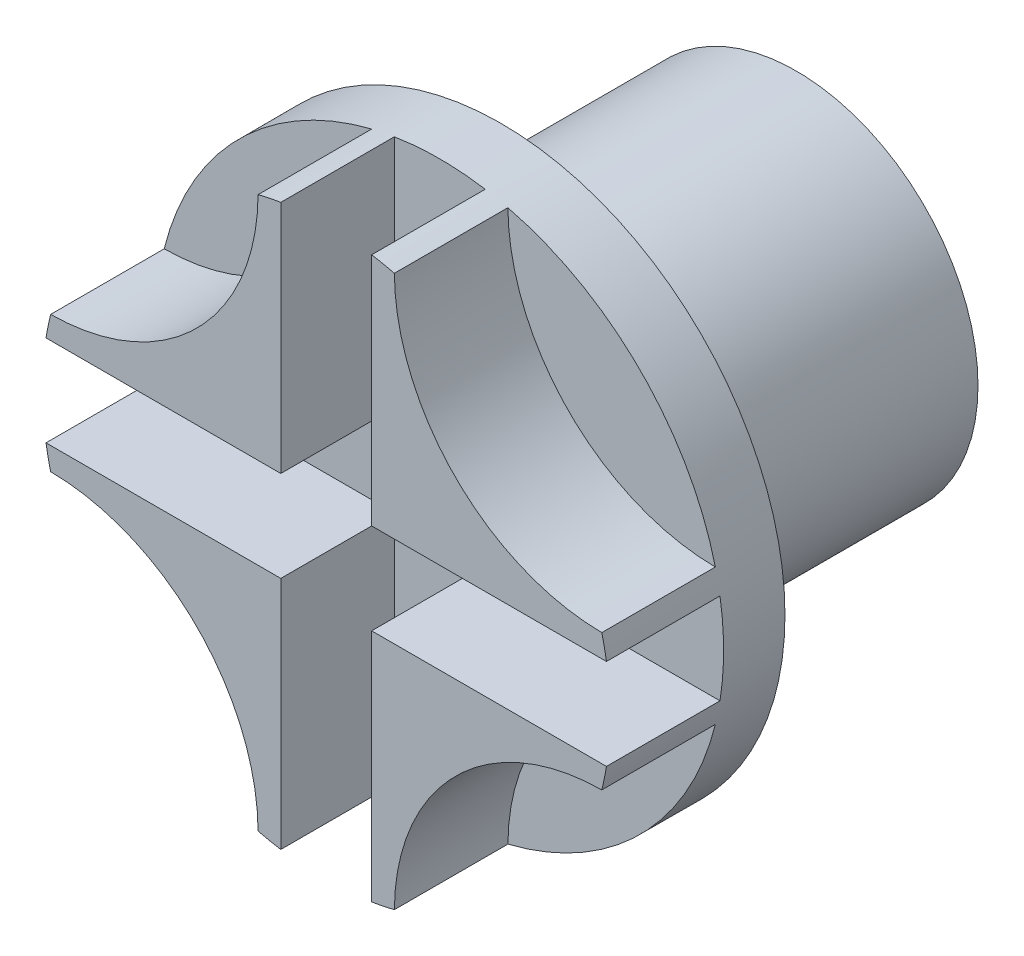
ISO-10303-21;
HEADER;
FILE_DESCRIPTION(('STEP AP214'),'2;1');
FILE_NAME('part.step','',(''),(''),'','','');
FILE_SCHEMA(('AUTOMOTIVE_DESIGN { 1 0 10303 214 1 1 1 1 }'));
ENDSEC;
DATA;
#1=APPLICATION_CONTEXT('core data for automotive mechanical design processes');
#2=APPLICATION_PROTOCOL_DEFINITION('international standard','automotive_design',2000,#1);
#3=PRODUCT_CONTEXT('',#1,'mechanical');
#4=PRODUCT('Part','Part','',(#3));
#5=PRODUCT_RELATED_PRODUCT_CATEGORY('part','',(#4));
#6=PRODUCT_DEFINITION_FORMATION('','',#4);
#7=PRODUCT_DEFINITION_CONTEXT('part definition',#1,'design');
#8=PRODUCT_DEFINITION('design','',#6,#7);
#9=PRODUCT_DEFINITION_SHAPE('','',#8);
#10=(LENGTH_UNIT() NAMED_UNIT(*) SI_UNIT(.MILLI.,.METRE.));
#11=(NAMED_UNIT(*) PLANE_ANGLE_UNIT() SI_UNIT($,.RADIAN.));
#12=(NAMED_UNIT(*) SI_UNIT($,.STERADIAN.) SOLID_ANGLE_UNIT());
#13=UNCERTAINTY_MEASURE_WITH_UNIT(LENGTH_MEASURE(1.E-05),#10,'distance_accuracy_value','');
#14=(GEOMETRIC_REPRESENTATION_CONTEXT(3) GLOBAL_UNCERTAINTY_ASSIGNED_CONTEXT((#13)) GLOBAL_UNIT_ASSIGNED_CONTEXT((#10,
#11,#12)) REPRESENTATION_CONTEXT('',''));
#15=CARTESIAN_POINT('',(0.,0.,0.));
#16=DIRECTION('',(0.,0.,1.));
#17=DIRECTION('',(1.,0.,0.));
#18=AXIS2_PLACEMENT_3D('',#15,#16,#17);
#19=CARTESIAN_POINT('',(0.,0.,2.7));
#20=DIRECTION('',(0.,0.,1.));
#21=DIRECTION('',(1.,0.,0.));
#22=AXIS2_PLACEMENT_3D('',#19,#20,#21);
#23=PLANE('',#22);
#24=DIRECTION('',(-1.,0.,0.));
#25=VECTOR('',#24,1.);
#26=CARTESIAN_POINT('',(0.,-2.,2.7));
#27=LINE('',#26,#25);
#28=CARTESIAN_POINT('',(-2.,-2.,2.7));
#29=VERTEX_POINT('',#28);
#30=CARTESIAN_POINT('',(-12.3389626792531,-2.,2.7));
#31=VERTEX_POINT('',#30);
#32=EDGE_CURVE('E50',#29,#31,#27,.T.);
#33=ORIENTED_EDGE('',*,*,#32,.F.);
#34=DIRECTION('',(0.,1.,0.));
#35=VECTOR('',#34,1.);
#36=CARTESIAN_POINT('',(-2.,0.,2.7));
#37=LINE('',#36,#35);
#38=CARTESIAN_POINT('',(-2.,-12.3389626792531,2.7));
#39=VERTEX_POINT('',#38);
#40=EDGE_CURVE('E206',#39,#29,#37,.T.);
#41=ORIENTED_EDGE('',*,*,#40,.F.);
#42=CARTESIAN_POINT('',(0.,0.,2.7));
#43=DIRECTION('',(0.,0.,1.));
#44=DIRECTION('',(1.,0.,0.));
#45=AXIS2_PLACEMENT_3D('',#42,#43,#44);
#46=CIRCLE('',#45,12.5);
#47=CARTESIAN_POINT('',(2.,-12.3389626792531,2.7));
#48=VERTEX_POINT('',#47);
#49=EDGE_CURVE('E317',#39,#48,#46,.T.);
#50=ORIENTED_EDGE('',*,*,#49,.T.);
#51=DIRECTION('',(0.,1.,0.));
#52=VECTOR('',#51,1.);
#53=CARTESIAN_POINT('',(2.,0.,2.7));
#54=LINE('',#53,#52);
#55=CARTESIAN_POINT('',(2.,-2.,2.7));
#56=VERTEX_POINT('',#55);
#57=EDGE_CURVE('E221',#48,#56,#54,.T.);
#58=ORIENTED_EDGE('',*,*,#57,.T.);
#59=DIRECTION('',(-1.,0.,0.));
#60=VECTOR('',#59,1.);
#61=CARTESIAN_POINT('',(0.,-2.,2.7));
#62=LINE('',#61,#60);
#63=CARTESIAN_POINT('',(12.3389626792531,-2.,2.7));
#64=VERTEX_POINT('',#63);
#65=EDGE_CURVE('E233',#64,#56,#62,.T.);
#66=ORIENTED_EDGE('',*,*,#65,.F.);
#67=CARTESIAN_POINT('',(12.3389626792531,2.,2.7));
#68=VERTEX_POINT('',#67);
#69=EDGE_CURVE('E326',#64,#68,#46,.T.);
#70=ORIENTED_EDGE('',*,*,#69,.T.);
#71=DIRECTION('',(1.,0.,0.));
#72=VECTOR('',#71,1.);
#73=CARTESIAN_POINT('',(0.,2.,2.7));
#74=LINE('',#73,#72);
#75=CARTESIAN_POINT('',(2.,2.,2.7));
#76=VERTEX_POINT('',#75);
#77=EDGE_CURVE('E255',#76,#68,#74,.T.);
#78=ORIENTED_EDGE('',*,*,#77,.F.);
#79=DIRECTION('',(0.,1.,0.));
#80=VECTOR('',#79,1.);
#81=CARTESIAN_POINT('',(2.,0.,2.7));
#82=LINE('',#81,#80);
#83=CARTESIAN_POINT('',(2.,12.3389626792531,2.7));
#84=VERTEX_POINT('',#83);
#85=EDGE_CURVE('E268',#76,#84,#82,.T.);
#86=ORIENTED_EDGE('',*,*,#85,.T.);
#87=CARTESIAN_POINT('',(-2.,12.3389626792531,2.7));
#88=VERTEX_POINT('',#87);
#89=EDGE_CURVE('E319',#84,#88,#46,.T.);
#90=ORIENTED_EDGE('',*,*,#89,.T.);
#91=DIRECTION('',(0.,1.,0.));
#92=VECTOR('',#91,1.);
#93=CARTESIAN_POINT('',(-2.,0.,2.7));
#94=LINE('',#93,#92);
#95=CARTESIAN_POINT('',(-2.,2.,2.7));
#96=VERTEX_POINT('',#95);
#97=EDGE_CURVE('E288',#96,#88,#94,.T.);
#98=ORIENTED_EDGE('',*,*,#97,.F.);
#99=DIRECTION('',(1.,0.,0.));
#100=VECTOR('',#99,1.);
#101=CARTESIAN_POINT('',(0.,2.,2.7));
#102=LINE('',#101,#100);
#103=CARTESIAN_POINT('',(-12.3389626792531,2.,2.7));
#104=VERTEX_POINT('',#103);
#105=EDGE_CURVE('E300',#104,#96,#102,.T.);
#106=ORIENTED_EDGE('',*,*,#105,.F.);
#107=EDGE_CURVE('E316',#104,#31,#46,.T.);
#108=ORIENTED_EDGE('',*,*,#107,.T.);
#109=EDGE_LOOP('',(#33,#41,#50,#58,#66,#70,#78,#86,#90,#98,#106,#108));
#110=FACE_BOUND('',#109,.T.);
#111=ADVANCED_FACE('F35',(#110),#23,.T.);
#112=CARTESIAN_POINT('',(-12.1997696102581,-12.1997696102581,2.7));
#113=DIRECTION('',(0.,0.,1.));
#114=DIRECTION('',(1.,0.,0.));
#115=AXIS2_PLACEMENT_3D('',#112,#113,#114);
#116=CIRCLE('',#115,9.2);
#117=CARTESIAN_POINT('',(-3.,-12.1346610995116,2.7));
#118=VERTEX_POINT('',#117);
#119=CARTESIAN_POINT('',(-12.1346610995116,-3.,2.7));
#120=VERTEX_POINT('',#119);
#121=EDGE_CURVE('E204',#118,#120,#116,.T.);
#122=ORIENTED_EDGE('',*,*,#121,.T.);
#123=EDGE_CURVE('E57',#120,#118,#46,.T.);
#124=ORIENTED_EDGE('',*,*,#123,.T.);
#125=EDGE_LOOP('',(#122,#124));
#126=FACE_BOUND('',#125,.T.);
#127=ADVANCED_FACE('F397',(#126),#23,.T.);
#128=CARTESIAN_POINT('',(12.1997696102581,12.1997696102581,2.7));
#129=DIRECTION('',(0.,0.,1.));
#130=DIRECTION('',(1.,0.,0.));
#131=AXIS2_PLACEMENT_3D('',#128,#129,#130);
#132=CIRCLE('',#131,9.2);
#133=CARTESIAN_POINT('',(3.,12.1346610995116,2.7));
#134=VERTEX_POINT('',#133);
#135=CARTESIAN_POINT('',(12.1346610995116,3.,2.7));
#136=VERTEX_POINT('',#135);
#137=EDGE_CURVE('E251',#134,#136,#132,.T.);
#138=ORIENTED_EDGE('',*,*,#137,.T.);
#139=EDGE_CURVE('E321',#136,#134,#46,.T.);
#140=ORIENTED_EDGE('',*,*,#139,.T.);
#141=EDGE_LOOP('',(#138,#140));
#142=FACE_BOUND('',#141,.T.);
#143=ADVANCED_FACE('F399',(#142),#23,.T.);
#144=CARTESIAN_POINT('',(-3.,12.1346610995116,2.7));
#145=VERTEX_POINT('',#144);
#146=CARTESIAN_POINT('',(-12.1346610995116,3.,2.7));
#147=VERTEX_POINT('',#146);
#148=EDGE_CURVE('E43',#145,#147,#46,.T.);
#149=ORIENTED_EDGE('',*,*,#148,.T.);
#150=CARTESIAN_POINT('',(-12.1997696102581,12.1997696102581,2.7));
#151=DIRECTION('',(0.,0.,1.));
#152=DIRECTION('',(1.,0.,0.));
#153=AXIS2_PLACEMENT_3D('',#150,#151,#152);
#154=CIRCLE('',#153,9.2);
#155=EDGE_CURVE('E284',#147,#145,#154,.T.);
#156=ORIENTED_EDGE('',*,*,#155,.T.);
#157=EDGE_LOOP('',(#149,#156));
#158=FACE_BOUND('',#157,.T.);
#159=ADVANCED_FACE('F388',(#158),#23,.T.);
#160=CARTESIAN_POINT('',(0.,0.,2.7));
#161=DIRECTION('',(0.,0.,-1.));
#162=DIRECTION('',(-1.,0.,0.));
#163=AXIS2_PLACEMENT_3D('',#160,#161,#162);
#164=CYLINDRICAL_SURFACE('',#163,12.5);
#165=ORIENTED_EDGE('',*,*,#148,.F.);
#166=DIRECTION('',(0.,0.,-1.));
#167=VECTOR('',#166,1.);
#168=CARTESIAN_POINT('',(-3.,12.1346610995116,7.7));
#169=LINE('',#168,#167);
#170=CARTESIAN_POINT('',(-3.,12.1346610995116,7.7));
#171=VERTEX_POINT('',#170);
#172=EDGE_CURVE('E313',#171,#145,#169,.T.);
#173=ORIENTED_EDGE('',*,*,#172,.F.);
#174=CARTESIAN_POINT('',(0.,0.,7.7));
#175=DIRECTION('',(0.,0.,1.));
#176=DIRECTION('',(1.,0.,0.));
#177=AXIS2_PLACEMENT_3D('',#174,#175,#176);
#178=CIRCLE('',#177,12.5);
#179=CARTESIAN_POINT('',(-2.,12.3389626792531,7.7));
#180=VERTEX_POINT('',#179);
#181=EDGE_CURVE('E285',#180,#171,#178,.T.);
#182=ORIENTED_EDGE('',*,*,#181,.F.);
#183=DIRECTION('',(0.,0.,-1.));
#184=VECTOR('',#183,1.);
#185=CARTESIAN_POINT('',(-2.,12.3389626792531,7.7));
#186=LINE('',#185,#184);
#187=EDGE_CURVE('E297',#180,#88,#186,.T.);
#188=ORIENTED_EDGE('',*,*,#187,.T.);
#189=ORIENTED_EDGE('',*,*,#89,.F.);
#190=DIRECTION('',(0.,0.,-1.));
#191=VECTOR('',#190,1.);
#192=CARTESIAN_POINT('',(2.,12.3389626792531,7.7));
#193=LINE('',#192,#191);
#194=CARTESIAN_POINT('',(2.,12.3389626792531,7.7));
#195=VERTEX_POINT('',#194);
#196=EDGE_CURVE('E278',#195,#84,#193,.T.);
#197=ORIENTED_EDGE('',*,*,#196,.F.);
#198=CARTESIAN_POINT('',(0.,0.,7.7));
#199=DIRECTION('',(0.,0.,1.));
#200=DIRECTION('',(1.,0.,0.));
#201=AXIS2_PLACEMENT_3D('',#198,#199,#200);
#202=CIRCLE('',#201,12.5);
#203=CARTESIAN_POINT('',(3.,12.1346610995116,7.7));
#204=VERTEX_POINT('',#203);
#205=EDGE_CURVE('E258',#204,#195,#202,.T.);
#206=ORIENTED_EDGE('',*,*,#205,.F.);
#207=DIRECTION('',(0.,0.,-1.));
#208=VECTOR('',#207,1.);
#209=CARTESIAN_POINT('',(3.,12.1346610995116,7.7));
#210=LINE('',#209,#208);
#211=EDGE_CURVE('E280',#204,#134,#210,.T.);
#212=ORIENTED_EDGE('',*,*,#211,.T.);
#213=ORIENTED_EDGE('',*,*,#139,.F.);
#214=DIRECTION('',(0.,0.,-1.));
#215=VECTOR('',#214,1.);
#216=CARTESIAN_POINT('',(12.1346610995116,3.,7.7));
#217=LINE('',#216,#215);
#218=CARTESIAN_POINT('',(12.1346610995116,3.,7.7));
#219=VERTEX_POINT('',#218);
#220=EDGE_CURVE('E282',#219,#136,#217,.T.);
#221=ORIENTED_EDGE('',*,*,#220,.F.);
#222=CARTESIAN_POINT('',(0.,0.,7.7));
#223=DIRECTION('',(0.,0.,1.));
#224=DIRECTION('',(1.,0.,0.));
#225=AXIS2_PLACEMENT_3D('',#222,#223,#224);
#226=CIRCLE('',#225,12.5);
#227=CARTESIAN_POINT('',(12.3389626792531,2.,7.7));
#228=VERTEX_POINT('',#227);
#229=EDGE_CURVE('E252',#228,#219,#226,.T.);
#230=ORIENTED_EDGE('',*,*,#229,.F.);
#231=DIRECTION('',(0.,0.,-1.));
#232=VECTOR('',#231,1.);
#233=CARTESIAN_POINT('',(12.3389626792531,2.,7.7));
#234=LINE('',#233,#232);
#235=EDGE_CURVE('E265',#228,#68,#234,.T.);
#236=ORIENTED_EDGE('',*,*,#235,.T.);
#237=ORIENTED_EDGE('',*,*,#69,.F.);
#238=DIRECTION('',(0.,0.,-1.));
#239=VECTOR('',#238,1.);
#240=CARTESIAN_POINT('',(12.3389626792531,-2.,7.7));
#241=LINE('',#240,#239);
#242=CARTESIAN_POINT('',(12.3389626792531,-2.,7.7));
#243=VERTEX_POINT('',#242);
#244=EDGE_CURVE('E242',#243,#64,#241,.T.);
#245=ORIENTED_EDGE('',*,*,#244,.F.);
#246=CARTESIAN_POINT('',(0.,0.,7.7));
#247=DIRECTION('',(0.,0.,1.));
#248=DIRECTION('',(1.,0.,0.));
#249=AXIS2_PLACEMENT_3D('',#246,#247,#248);
#250=CIRCLE('',#249,12.5);
#251=CARTESIAN_POINT('',(12.1346610995116,-3.,7.7));
#252=VERTEX_POINT('',#251);
#253=EDGE_CURVE('E224',#252,#243,#250,.T.);
#254=ORIENTED_EDGE('',*,*,#253,.F.);
#255=DIRECTION('',(0.,0.,-1.));
#256=VECTOR('',#255,1.);
#257=CARTESIAN_POINT('',(12.1346610995116,-3.,7.7));
#258=LINE('',#257,#256);
#259=CARTESIAN_POINT('',(12.1346610995116,-3.,2.7));
#260=VERTEX_POINT('',#259);
#261=EDGE_CURVE('E245',#252,#260,#258,.T.);
#262=ORIENTED_EDGE('',*,*,#261,.T.);
#263=CARTESIAN_POINT('',(3.,-12.1346610995116,2.7));
#264=VERTEX_POINT('',#263);
#265=EDGE_CURVE('E322',#264,#260,#46,.T.);
#266=ORIENTED_EDGE('',*,*,#265,.F.);
#267=DIRECTION('',(0.,0.,-1.));
#268=VECTOR('',#267,1.);
#269=CARTESIAN_POINT('',(3.,-12.1346610995116,7.7));
#270=LINE('',#269,#268);
#271=CARTESIAN_POINT('',(3.,-12.1346610995116,7.7));
#272=VERTEX_POINT('',#271);
#273=EDGE_CURVE('E248',#272,#264,#270,.T.);
#274=ORIENTED_EDGE('',*,*,#273,.F.);
#275=CARTESIAN_POINT('',(0.,0.,7.7));
#276=DIRECTION('',(0.,0.,1.));
#277=DIRECTION('',(1.,0.,0.));
#278=AXIS2_PLACEMENT_3D('',#275,#276,#277);
#279=CIRCLE('',#278,12.5);
#280=CARTESIAN_POINT('',(2.,-12.3389626792531,7.7));
#281=VERTEX_POINT('',#280);
#282=EDGE_CURVE('E218',#281,#272,#279,.T.);
#283=ORIENTED_EDGE('',*,*,#282,.F.);
#284=DIRECTION('',(0.,0.,-1.));
#285=VECTOR('',#284,1.);
#286=CARTESIAN_POINT('',(2.,-12.3389626792531,7.7));
#287=LINE('',#286,#285);
#288=EDGE_CURVE('E231',#281,#48,#287,.T.);
#289=ORIENTED_EDGE('',*,*,#288,.T.);
#290=ORIENTED_EDGE('',*,*,#49,.F.);
#291=DIRECTION('',(0.,0.,-1.));
#292=VECTOR('',#291,1.);
#293=CARTESIAN_POINT('',(-2.,-12.3389626792531,7.7));
#294=LINE('',#293,#292);
#295=CARTESIAN_POINT('',(-2.,-12.3389626792531,7.7));
#296=VERTEX_POINT('',#295);
#297=EDGE_CURVE('E214',#296,#39,#294,.T.);
#298=ORIENTED_EDGE('',*,*,#297,.F.);
#299=CARTESIAN_POINT('',(0.,0.,7.7));
#300=DIRECTION('',(0.,0.,1.));
#301=DIRECTION('',(1.,0.,0.));
#302=AXIS2_PLACEMENT_3D('',#299,#300,#301);
#303=CIRCLE('',#302,12.5);
#304=CARTESIAN_POINT('',(-3.,-12.1346610995116,7.7));
#305=VERTEX_POINT('',#304);
#306=EDGE_CURVE('E195',#305,#296,#303,.T.);
#307=ORIENTED_EDGE('',*,*,#306,.F.);
#308=DIRECTION('',(0.,0.,-1.));
#309=VECTOR('',#308,1.);
#310=CARTESIAN_POINT('',(-3.,-12.1346610995116,7.7));
#311=LINE('',#310,#309);
#312=EDGE_CURVE('E191',#305,#118,#311,.T.);
#313=ORIENTED_EDGE('',*,*,#312,.T.);
#314=ORIENTED_EDGE('',*,*,#123,.F.);
#315=DIRECTION('',(0.,0.,-1.));
#316=VECTOR('',#315,1.);
#317=CARTESIAN_POINT('',(-12.1346610995116,-3.,7.7));
#318=LINE('',#317,#316);
#319=CARTESIAN_POINT('',(-12.1346610995116,-3.,7.7));
#320=VERTEX_POINT('',#319);
#321=EDGE_CURVE('E185',#320,#120,#318,.T.);
#322=ORIENTED_EDGE('',*,*,#321,.F.);
#323=CARTESIAN_POINT('',(0.,0.,7.7));
#324=DIRECTION('',(0.,0.,1.));
#325=DIRECTION('',(1.,0.,0.));
#326=AXIS2_PLACEMENT_3D('',#323,#324,#325);
#327=CIRCLE('',#326,12.5);
#328=CARTESIAN_POINT('',(-12.3389626792531,-2.,7.7));
#329=VERTEX_POINT('',#328);
#330=EDGE_CURVE('E173',#329,#320,#327,.T.);
#331=ORIENTED_EDGE('',*,*,#330,.F.);
#332=DIRECTION('',(0.,0.,-1.));
#333=VECTOR('',#332,1.);
#334=CARTESIAN_POINT('',(-12.3389626792531,-2.,7.7));
#335=LINE('',#334,#333);
#336=EDGE_CURVE('E203',#329,#31,#335,.T.);
#337=ORIENTED_EDGE('',*,*,#336,.T.);
#338=ORIENTED_EDGE('',*,*,#107,.F.);
#339=DIRECTION('',(0.,0.,-1.));
#340=VECTOR('',#339,1.);
#341=CARTESIAN_POINT('',(-12.3389626792531,2.,7.7));
#342=LINE('',#341,#340);
#343=CARTESIAN_POINT('',(-12.3389626792531,2.,7.7));
#344=VERTEX_POINT('',#343);
#345=EDGE_CURVE('E309',#344,#104,#342,.T.);
#346=ORIENTED_EDGE('',*,*,#345,.F.);
#347=CARTESIAN_POINT('',(0.,0.,7.7));
#348=DIRECTION('',(0.,0.,1.));
#349=DIRECTION('',(1.,0.,0.));
#350=AXIS2_PLACEMENT_3D('',#347,#348,#349);
#351=CIRCLE('',#350,12.5);
#352=CARTESIAN_POINT('',(-12.1346610995116,3.,7.7));
#353=VERTEX_POINT('',#352);
#354=EDGE_CURVE('E291',#353,#344,#351,.T.);
#355=ORIENTED_EDGE('',*,*,#354,.F.);
#356=DIRECTION('',(0.,0.,-1.));
#357=VECTOR('',#356,1.);
#358=CARTESIAN_POINT('',(-12.1346610995116,3.,7.7));
#359=LINE('',#358,#357);
#360=EDGE_CURVE('E311',#353,#147,#359,.T.);
#361=ORIENTED_EDGE('',*,*,#360,.T.);
#362=EDGE_LOOP('',(#165,#173,#182,#188,#189,#197,#206,#212,#213,#221,#230,#236,#237,#245,#254,
#262,#266,#274,#283,#289,#290,#298,#307,#313,#314,#322,#331,#337,#338,#346,#355,#361));
#363=FACE_BOUND('',#362,.T.);
#364=CARTESIAN_POINT('',(0.,0.,0.));
#365=DIRECTION('',(0.,0.,1.));
#366=DIRECTION('',(1.,0.,0.));
#367=AXIS2_PLACEMENT_3D('',#364,#365,#366);
#368=CIRCLE('',#367,12.5);
#369=CARTESIAN_POINT('',(12.5,0.,0.));
#370=VERTEX_POINT('',#369);
#371=EDGE_CURVE('E315',#370,#370,#368,.T.);
#372=ORIENTED_EDGE('',*,*,#371,.T.);
#373=EDGE_LOOP('',(#372));
#374=FACE_BOUND('',#373,.T.);
#375=ADVANCED_FACE('F37',(#363,#374),#164,.T.);
#376=CARTESIAN_POINT('',(12.1997696102581,-12.1997696102581,2.7));
#377=DIRECTION('',(0.,0.,1.));
#378=DIRECTION('',(1.,0.,0.));
#379=AXIS2_PLACEMENT_3D('',#376,#377,#378);
#380=CIRCLE('',#379,9.2);
#381=EDGE_CURVE('E190',#260,#264,#380,.T.);
#382=ORIENTED_EDGE('',*,*,#381,.T.);
#383=ORIENTED_EDGE('',*,*,#265,.T.);
#384=EDGE_LOOP('',(#382,#383));
#385=FACE_BOUND('',#384,.T.);
#386=ADVANCED_FACE('F384',(#385),#23,.T.);
#387=CARTESIAN_POINT('',(0.,0.,0.));
#388=DIRECTION('',(0.,0.,1.));
#389=DIRECTION('',(1.,0.,0.));
#390=AXIS2_PLACEMENT_3D('',#387,#388,#389);
#391=PLANE('',#390);
#392=CARTESIAN_POINT('',(0.,0.,0.));
#393=DIRECTION('',(0.,0.,1.));
#394=DIRECTION('',(1.,0.,0.));
#395=AXIS2_PLACEMENT_3D('',#392,#393,#394);
#396=CIRCLE('',#395,8.);
#397=CARTESIAN_POINT('',(8.,0.,0.));
#398=VERTEX_POINT('',#397);
#399=EDGE_CURVE('E11',#398,#398,#396,.F.);
#400=ORIENTED_EDGE('',*,*,#399,.F.);
#401=EDGE_LOOP('',(#400));
#402=FACE_BOUND('',#401,.T.);
#403=ORIENTED_EDGE('',*,*,#371,.F.);
#404=EDGE_LOOP('',(#403));
#405=FACE_BOUND('',#404,.T.);
#406=ADVANCED_FACE('F386',(#402,#405),#391,.F.);
#407=CARTESIAN_POINT('',(-12.1997696102581,12.1997696102581,7.7));
#408=DIRECTION('',(0.,0.,-1.));
#409=DIRECTION('',(-1.,0.,0.));
#410=AXIS2_PLACEMENT_3D('',#407,#408,#409);
#411=CYLINDRICAL_SURFACE('',#410,9.2);
#412=ORIENTED_EDGE('',*,*,#155,.F.);
#413=ORIENTED_EDGE('',*,*,#360,.F.);
#414=CARTESIAN_POINT('',(-12.1997696102581,12.1997696102581,7.7));
#415=DIRECTION('',(0.,0.,1.));
#416=DIRECTION('',(1.,0.,0.));
#417=AXIS2_PLACEMENT_3D('',#414,#415,#416);
#418=CIRCLE('',#417,9.2);
#419=EDGE_CURVE('E287',#353,#171,#418,.T.);
#420=ORIENTED_EDGE('',*,*,#419,.T.);
#421=ORIENTED_EDGE('',*,*,#172,.T.);
#422=EDGE_LOOP('',(#412,#413,#420,#421));
#423=FACE_BOUND('',#422,.T.);
#424=ADVANCED_FACE('F393',(#423),#411,.F.);
#425=CARTESIAN_POINT('',(0.,2.,7.7));
#426=DIRECTION('',(0.,1.,0.));
#427=DIRECTION('',(-1.,0.,0.));
#428=AXIS2_PLACEMENT_3D('',#425,#426,#427);
#429=PLANE('',#428);
#430=ORIENTED_EDGE('',*,*,#105,.T.);
#431=DIRECTION('',(0.,0.,-1.));
#432=VECTOR('',#431,1.);
#433=CARTESIAN_POINT('',(-2.,2.,7.7));
#434=LINE('',#433,#432);
#435=CARTESIAN_POINT('',(-2.,2.,7.7));
#436=VERTEX_POINT('',#435);
#437=EDGE_CURVE('E306',#436,#96,#434,.T.);
#438=ORIENTED_EDGE('',*,*,#437,.F.);
#439=DIRECTION('',(1.,0.,0.));
#440=VECTOR('',#439,1.);
#441=CARTESIAN_POINT('',(0.,2.,7.7));
#442=LINE('',#441,#440);
#443=EDGE_CURVE('E293',#344,#436,#442,.T.);
#444=ORIENTED_EDGE('',*,*,#443,.F.);
#445=ORIENTED_EDGE('',*,*,#345,.T.);
#446=EDGE_LOOP('',(#430,#438,#444,#445));
#447=FACE_BOUND('',#446,.T.);
#448=ADVANCED_FACE('F411',(#447),#429,.F.);
#449=CARTESIAN_POINT('',(-2.,0.,7.7));
#450=DIRECTION('',(-1.,0.,0.));
#451=DIRECTION('',(0.,0.,1.));
#452=AXIS2_PLACEMENT_3D('',#449,#450,#451);
#453=PLANE('',#452);
#454=ORIENTED_EDGE('',*,*,#97,.T.);
#455=ORIENTED_EDGE('',*,*,#187,.F.);
#456=DIRECTION('',(0.,1.,0.));
#457=VECTOR('',#456,1.);
#458=CARTESIAN_POINT('',(-2.,0.,7.7));
#459=LINE('',#458,#457);
#460=EDGE_CURVE('E295',#436,#180,#459,.T.);
#461=ORIENTED_EDGE('',*,*,#460,.F.);
#462=ORIENTED_EDGE('',*,*,#437,.T.);
#463=EDGE_LOOP('',(#454,#455,#461,#462));
#464=FACE_BOUND('',#463,.T.);
#465=ADVANCED_FACE('F352',(#464),#453,.F.);
#466=CARTESIAN_POINT('',(0.,0.,7.7));
#467=DIRECTION('',(0.,0.,1.));
#468=DIRECTION('',(1.,0.,0.));
#469=AXIS2_PLACEMENT_3D('',#466,#467,#468);
#470=PLANE('',#469);
#471=ORIENTED_EDGE('',*,*,#181,.T.);
#472=ORIENTED_EDGE('',*,*,#419,.F.);
#473=ORIENTED_EDGE('',*,*,#354,.T.);
#474=ORIENTED_EDGE('',*,*,#443,.T.);
#475=ORIENTED_EDGE('',*,*,#460,.T.);
#476=EDGE_LOOP('',(#471,#472,#473,#474,#475));
#477=FACE_BOUND('',#476,.T.);
#478=ADVANCED_FACE('F410',(#477),#470,.T.);
#479=CARTESIAN_POINT('',(12.1997696102581,12.1997696102581,7.7));
#480=DIRECTION('',(0.,0.,-1.));
#481=DIRECTION('',(-1.,0.,0.));
#482=AXIS2_PLACEMENT_3D('',#479,#480,#481);
#483=CYLINDRICAL_SURFACE('',#482,9.2);
#484=ORIENTED_EDGE('',*,*,#137,.F.);
#485=ORIENTED_EDGE('',*,*,#211,.F.);
#486=CARTESIAN_POINT('',(12.1997696102581,12.1997696102581,7.7));
#487=DIRECTION('',(0.,0.,1.));
#488=DIRECTION('',(1.,0.,0.));
#489=AXIS2_PLACEMENT_3D('',#486,#487,#488);
#490=CIRCLE('',#489,9.2);
#491=EDGE_CURVE('E254',#204,#219,#490,.T.);
#492=ORIENTED_EDGE('',*,*,#491,.T.);
#493=ORIENTED_EDGE('',*,*,#220,.T.);
#494=EDGE_LOOP('',(#484,#485,#492,#493));
#495=FACE_BOUND('',#494,.T.);
#496=ADVANCED_FACE('F422',(#495),#483,.F.);
#497=CARTESIAN_POINT('',(2.,0.,7.7));
#498=DIRECTION('',(-1.,0.,0.));
#499=DIRECTION('',(0.,0.,1.));
#500=AXIS2_PLACEMENT_3D('',#497,#498,#499);
#501=PLANE('',#500);
#502=ORIENTED_EDGE('',*,*,#85,.F.);
#503=DIRECTION('',(0.,0.,-1.));
#504=VECTOR('',#503,1.);
#505=CARTESIAN_POINT('',(2.,2.,7.7));
#506=LINE('',#505,#504);
#507=CARTESIAN_POINT('',(2.,2.,7.7));
#508=VERTEX_POINT('',#507);
#509=EDGE_CURVE('E275',#508,#76,#506,.T.);
#510=ORIENTED_EDGE('',*,*,#509,.F.);
#511=DIRECTION('',(0.,1.,0.));
#512=VECTOR('',#511,1.);
#513=CARTESIAN_POINT('',(2.,0.,7.7));
#514=LINE('',#513,#512);
#515=EDGE_CURVE('E260',#508,#195,#514,.T.);
#516=ORIENTED_EDGE('',*,*,#515,.T.);
#517=ORIENTED_EDGE('',*,*,#196,.T.);
#518=EDGE_LOOP('',(#502,#510,#516,#517));
#519=FACE_BOUND('',#518,.T.);
#520=ADVANCED_FACE('F346',(#519),#501,.T.);
#521=CARTESIAN_POINT('',(0.,2.,7.7));
#522=DIRECTION('',(0.,1.,0.));
#523=DIRECTION('',(-1.,0.,0.));
#524=AXIS2_PLACEMENT_3D('',#521,#522,#523);
#525=PLANE('',#524);
#526=ORIENTED_EDGE('',*,*,#77,.T.);
#527=ORIENTED_EDGE('',*,*,#235,.F.);
#528=DIRECTION('',(1.,0.,0.));
#529=VECTOR('',#528,1.);
#530=CARTESIAN_POINT('',(0.,2.,7.7));
#531=LINE('',#530,#529);
#532=EDGE_CURVE('E263',#508,#228,#531,.T.);
#533=ORIENTED_EDGE('',*,*,#532,.F.);
#534=ORIENTED_EDGE('',*,*,#509,.T.);
#535=EDGE_LOOP('',(#526,#527,#533,#534));
#536=FACE_BOUND('',#535,.T.);
#537=ADVANCED_FACE('F334',(#536),#525,.F.);
#538=CARTESIAN_POINT('',(0.,0.,7.7));
#539=DIRECTION('',(0.,0.,1.));
#540=DIRECTION('',(1.,0.,0.));
#541=AXIS2_PLACEMENT_3D('',#538,#539,#540);
#542=PLANE('',#541);
#543=ORIENTED_EDGE('',*,*,#229,.T.);
#544=ORIENTED_EDGE('',*,*,#491,.F.);
#545=ORIENTED_EDGE('',*,*,#205,.T.);
#546=ORIENTED_EDGE('',*,*,#515,.F.);
#547=ORIENTED_EDGE('',*,*,#532,.T.);
#548=EDGE_LOOP('',(#543,#544,#545,#546,#547));
#549=FACE_BOUND('',#548,.T.);
#550=ADVANCED_FACE('F341',(#549),#542,.T.);
#551=CARTESIAN_POINT('',(12.1997696102581,-12.1997696102581,7.7));
#552=DIRECTION('',(0.,0.,-1.));
#553=DIRECTION('',(-1.,0.,0.));
#554=AXIS2_PLACEMENT_3D('',#551,#552,#553);
#555=CYLINDRICAL_SURFACE('',#554,9.2);
#556=ORIENTED_EDGE('',*,*,#381,.F.);
#557=ORIENTED_EDGE('',*,*,#261,.F.);
#558=CARTESIAN_POINT('',(12.1997696102581,-12.1997696102581,7.7));
#559=DIRECTION('',(0.,0.,1.));
#560=DIRECTION('',(1.,0.,0.));
#561=AXIS2_PLACEMENT_3D('',#558,#559,#560);
#562=CIRCLE('',#561,9.2);
#563=EDGE_CURVE('E220',#252,#272,#562,.T.);
#564=ORIENTED_EDGE('',*,*,#563,.T.);
#565=ORIENTED_EDGE('',*,*,#273,.T.);
#566=EDGE_LOOP('',(#556,#557,#564,#565));
#567=FACE_BOUND('',#566,.T.);
#568=ADVANCED_FACE('F383',(#567),#555,.F.);
#569=CARTESIAN_POINT('',(0.,-2.,7.7));
#570=DIRECTION('',(0.,-1.,0.));
#571=DIRECTION('',(1.,0.,0.));
#572=AXIS2_PLACEMENT_3D('',#569,#570,#571);
#573=PLANE('',#572);
#574=ORIENTED_EDGE('',*,*,#65,.T.);
#575=DIRECTION('',(0.,0.,-1.));
#576=VECTOR('',#575,1.);
#577=CARTESIAN_POINT('',(2.,-2.,7.7));
#578=LINE('',#577,#576);
#579=CARTESIAN_POINT('',(2.,-2.,7.7));
#580=VERTEX_POINT('',#579);
#581=EDGE_CURVE('E239',#580,#56,#578,.T.);
#582=ORIENTED_EDGE('',*,*,#581,.F.);
#583=DIRECTION('',(-1.,0.,0.));
#584=VECTOR('',#583,1.);
#585=CARTESIAN_POINT('',(0.,-2.,7.7));
#586=LINE('',#585,#584);
#587=EDGE_CURVE('E226',#243,#580,#586,.T.);
#588=ORIENTED_EDGE('',*,*,#587,.F.);
#589=ORIENTED_EDGE('',*,*,#244,.T.);
#590=EDGE_LOOP('',(#574,#582,#588,#589));
#591=FACE_BOUND('',#590,.T.);
#592=ADVANCED_FACE('F376',(#591),#573,.F.);
#593=CARTESIAN_POINT('',(2.,0.,7.7));
#594=DIRECTION('',(-1.,0.,0.));
#595=DIRECTION('',(0.,0.,1.));
#596=AXIS2_PLACEMENT_3D('',#593,#594,#595);
#597=PLANE('',#596);
#598=ORIENTED_EDGE('',*,*,#57,.F.);
#599=ORIENTED_EDGE('',*,*,#288,.F.);
#600=DIRECTION('',(0.,1.,0.));
#601=VECTOR('',#600,1.);
#602=CARTESIAN_POINT('',(2.,0.,7.7));
#603=LINE('',#602,#601);
#604=EDGE_CURVE('E228',#281,#580,#603,.T.);
#605=ORIENTED_EDGE('',*,*,#604,.T.);
#606=ORIENTED_EDGE('',*,*,#581,.T.);
#607=EDGE_LOOP('',(#598,#599,#605,#606));
#608=FACE_BOUND('',#607,.T.);
#609=ADVANCED_FACE('F372',(#608),#597,.T.);
#610=CARTESIAN_POINT('',(0.,0.,7.7));
#611=DIRECTION('',(0.,0.,1.));
#612=DIRECTION('',(1.,0.,0.));
#613=AXIS2_PLACEMENT_3D('',#610,#611,#612);
#614=PLANE('',#613);
#615=ORIENTED_EDGE('',*,*,#282,.T.);
#616=ORIENTED_EDGE('',*,*,#563,.F.);
#617=ORIENTED_EDGE('',*,*,#253,.T.);
#618=ORIENTED_EDGE('',*,*,#587,.T.);
#619=ORIENTED_EDGE('',*,*,#604,.F.);
#620=EDGE_LOOP('',(#615,#616,#617,#618,#619));
#621=FACE_BOUND('',#620,.T.);
#622=ADVANCED_FACE('F381',(#621),#614,.T.);
#623=CARTESIAN_POINT('',(-12.1997696102581,-12.1997696102581,7.7));
#624=DIRECTION('',(0.,0.,-1.));
#625=DIRECTION('',(-1.,0.,0.));
#626=AXIS2_PLACEMENT_3D('',#623,#624,#625);
#627=CYLINDRICAL_SURFACE('',#626,9.2);
#628=ORIENTED_EDGE('',*,*,#121,.F.);
#629=ORIENTED_EDGE('',*,*,#312,.F.);
#630=CARTESIAN_POINT('',(-12.1997696102581,-12.1997696102581,7.7));
#631=DIRECTION('',(0.,0.,1.));
#632=DIRECTION('',(1.,0.,0.));
#633=AXIS2_PLACEMENT_3D('',#630,#631,#632);
#634=CIRCLE('',#633,9.2);
#635=EDGE_CURVE('E177',#305,#320,#634,.T.);
#636=ORIENTED_EDGE('',*,*,#635,.T.);
#637=ORIENTED_EDGE('',*,*,#321,.T.);
#638=EDGE_LOOP('',(#628,#629,#636,#637));
#639=FACE_BOUND('',#638,.T.);
#640=ADVANCED_FACE('F193',(#639),#627,.F.);
#641=CARTESIAN_POINT('',(-2.,0.,7.7));
#642=DIRECTION('',(-1.,0.,0.));
#643=DIRECTION('',(0.,0.,1.));
#644=AXIS2_PLACEMENT_3D('',#641,#642,#643);
#645=PLANE('',#644);
#646=ORIENTED_EDGE('',*,*,#40,.T.);
#647=DIRECTION('',(0.,0.,-1.));
#648=VECTOR('',#647,1.);
#649=CARTESIAN_POINT('',(-2.,-2.,7.7));
#650=LINE('',#649,#648);
#651=CARTESIAN_POINT('',(-2.,-2.,7.7));
#652=VERTEX_POINT('',#651);
#653=EDGE_CURVE('E211',#652,#29,#650,.T.);
#654=ORIENTED_EDGE('',*,*,#653,.F.);
#655=DIRECTION('',(0.,1.,0.));
#656=VECTOR('',#655,1.);
#657=CARTESIAN_POINT('',(-2.,0.,7.7));
#658=LINE('',#657,#656);
#659=EDGE_CURVE('E197',#296,#652,#658,.T.);
#660=ORIENTED_EDGE('',*,*,#659,.F.);
#661=ORIENTED_EDGE('',*,*,#297,.T.);
#662=EDGE_LOOP('',(#646,#654,#660,#661));
#663=FACE_BOUND('',#662,.T.);
#664=ADVANCED_FACE('F365',(#663),#645,.F.);
#665=CARTESIAN_POINT('',(0.,-2.,7.7));
#666=DIRECTION('',(0.,-1.,0.));
#667=DIRECTION('',(1.,0.,0.));
#668=AXIS2_PLACEMENT_3D('',#665,#666,#667);
#669=PLANE('',#668);
#670=ORIENTED_EDGE('',*,*,#32,.T.);
#671=ORIENTED_EDGE('',*,*,#336,.F.);
#672=DIRECTION('',(-1.,0.,0.));
#673=VECTOR('',#672,1.);
#674=CARTESIAN_POINT('',(0.,-2.,7.7));
#675=LINE('',#674,#673);
#676=EDGE_CURVE('E179',#652,#329,#675,.T.);
#677=ORIENTED_EDGE('',*,*,#676,.F.);
#678=ORIENTED_EDGE('',*,*,#653,.T.);
#679=EDGE_LOOP('',(#670,#671,#677,#678));
#680=FACE_BOUND('',#679,.T.);
#681=ADVANCED_FACE('F361',(#680),#669,.F.);
#682=CARTESIAN_POINT('',(0.,0.,7.7));
#683=DIRECTION('',(0.,0.,1.));
#684=DIRECTION('',(1.,0.,0.));
#685=AXIS2_PLACEMENT_3D('',#682,#683,#684);
#686=PLANE('',#685);
#687=ORIENTED_EDGE('',*,*,#330,.T.);
#688=ORIENTED_EDGE('',*,*,#635,.F.);
#689=ORIENTED_EDGE('',*,*,#306,.T.);
#690=ORIENTED_EDGE('',*,*,#659,.T.);
#691=ORIENTED_EDGE('',*,*,#676,.T.);
#692=EDGE_LOOP('',(#687,#688,#689,#690,#691));
#693=FACE_BOUND('',#692,.T.);
#694=ADVANCED_FACE('F175',(#693),#686,.T.);
#695=CARTESIAN_POINT('',(0.,0.,-13.));
#696=DIRECTION('',(0.,0.,1.));
#697=DIRECTION('',(1.,0.,0.));
#698=AXIS2_PLACEMENT_3D('',#695,#696,#697);
#699=CYLINDRICAL_SURFACE('',#698,8.);
#700=CARTESIAN_POINT('',(0.,0.,-13.));
#701=DIRECTION('',(0.,0.,-1.));
#702=DIRECTION('',(-1.,0.,0.));
#703=AXIS2_PLACEMENT_3D('',#700,#701,#702);
#704=CIRCLE('',#703,8.);
#705=CARTESIAN_POINT('',(-8.,0.,-13.));
#706=VERTEX_POINT('',#705);
#707=EDGE_CURVE('E207',#706,#706,#704,.T.);
#708=ORIENTED_EDGE('',*,*,#707,.F.);
#709=EDGE_LOOP('',(#708));
#710=FACE_BOUND('',#709,.T.);
#711=ORIENTED_EDGE('',*,*,#399,.T.);
#712=EDGE_LOOP('',(#711));
#713=FACE_BOUND('',#712,.T.);
#714=ADVANCED_FACE('F448',(#710,#713),#699,.T.);
#715=CARTESIAN_POINT('',(0.,0.,-13.));
#716=DIRECTION('',(0.,0.,-1.));
#717=DIRECTION('',(-1.,0.,0.));
#718=AXIS2_PLACEMENT_3D('',#715,#716,#717);
#719=PLANE('',#718);
#720=ORIENTED_EDGE('',*,*,#707,.T.);
#721=EDGE_LOOP('',(#720));
#722=FACE_BOUND('',#721,.T.);
#723=ADVANCED_FACE('F451',(#722),#719,.T.);
#724=CLOSED_SHELL('',(#111,#127,#143,#159,#375,#386,#406,#424,#448,#465,#478,#496,#520,#537,
#550,#568,#592,#609,#622,#640,#664,#681,#694,#714,#723));
#725=MANIFOLD_SOLID_BREP('B2',#724);
#726=ADVANCED_BREP_SHAPE_REPRESENTATION('',(#18,#725),#14);
#727=SHAPE_DEFINITION_REPRESENTATION(#9,#726);
ENDSEC;
END-ISO-10303-21;
